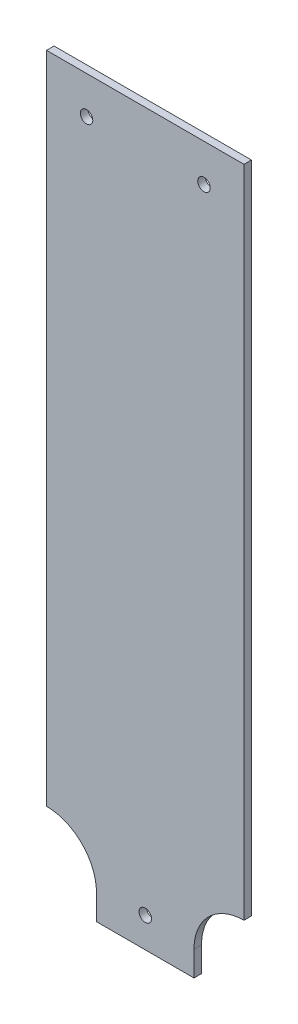
ISO-10303-21;
HEADER;
FILE_DESCRIPTION(('STEP AP214'),'2;1');
FILE_NAME('part.step','',(''),(''),'','','');
FILE_SCHEMA(('AUTOMOTIVE_DESIGN { 1 0 10303 214 1 1 1 1 }'));
ENDSEC;
DATA;
#1=APPLICATION_CONTEXT('core data for automotive mechanical design processes');
#2=APPLICATION_PROTOCOL_DEFINITION('international standard','automotive_design',2000,#1);
#3=PRODUCT_CONTEXT('',#1,'mechanical');
#4=PRODUCT('Part','Part','',(#3));
#5=PRODUCT_RELATED_PRODUCT_CATEGORY('part','',(#4));
#6=PRODUCT_DEFINITION_FORMATION('','',#4);
#7=PRODUCT_DEFINITION_CONTEXT('part definition',#1,'design');
#8=PRODUCT_DEFINITION('design','',#6,#7);
#9=PRODUCT_DEFINITION_SHAPE('','',#8);
#10=(LENGTH_UNIT() NAMED_UNIT(*) SI_UNIT(.MILLI.,.METRE.));
#11=(NAMED_UNIT(*) PLANE_ANGLE_UNIT() SI_UNIT($,.RADIAN.));
#12=(NAMED_UNIT(*) SI_UNIT($,.STERADIAN.) SOLID_ANGLE_UNIT());
#13=UNCERTAINTY_MEASURE_WITH_UNIT(LENGTH_MEASURE(1.E-05),#10,'distance_accuracy_value','');
#14=(GEOMETRIC_REPRESENTATION_CONTEXT(3) GLOBAL_UNCERTAINTY_ASSIGNED_CONTEXT((#13)) GLOBAL_UNIT_ASSIGNED_CONTEXT((#10,
#11,#12)) REPRESENTATION_CONTEXT('',''));
#15=CARTESIAN_POINT('',(0.,0.,0.));
#16=DIRECTION('',(0.,0.,1.));
#17=DIRECTION('',(1.,0.,0.));
#18=AXIS2_PLACEMENT_3D('',#15,#16,#17);
#19=CARTESIAN_POINT('',(-39.5,9.99999999999999,3.));
#20=DIRECTION('',(0.,0.,-1.));
#21=DIRECTION('',(-1.,0.,0.));
#22=AXIS2_PLACEMENT_3D('',#19,#20,#21);
#23=PLANE('',#22);
#24=CARTESIAN_POINT('',(23.5,277.,3.));
#25=DIRECTION('',(0.,0.,1.));
#26=DIRECTION('',(-1.,0.,0.));
#27=AXIS2_PLACEMENT_3D('',#24,#25,#26);
#28=CIRCLE('',#27,2.5);
#29=CARTESIAN_POINT('',(21.,277.,3.));
#30=VERTEX_POINT('',#29);
#31=EDGE_CURVE('E180',#30,#30,#28,.T.);
#32=ORIENTED_EDGE('',*,*,#31,.F.);
#33=EDGE_LOOP('',(#32));
#34=FACE_BOUND('',#33,.T.);
#35=DIRECTION('',(0.,-1.,0.));
#36=VECTOR('',#35,1.);
#37=CARTESIAN_POINT('',(-39.5,292.,3.));
#38=LINE('',#37,#36);
#39=CARTESIAN_POINT('',(-39.5,292.,3.));
#40=VERTEX_POINT('',#39);
#41=CARTESIAN_POINT('',(-39.5,30.,3.));
#42=VERTEX_POINT('',#41);
#43=EDGE_CURVE('E143',#40,#42,#38,.T.);
#44=ORIENTED_EDGE('',*,*,#43,.T.);
#45=CARTESIAN_POINT('',(-39.5,9.99999999999999,3.));
#46=DIRECTION('',(0.,0.,-1.));
#47=DIRECTION('',(-1.,0.,0.));
#48=AXIS2_PLACEMENT_3D('',#45,#46,#47);
#49=CIRCLE('',#48,20.);
#50=CARTESIAN_POINT('',(-19.5,9.99999999999999,3.));
#51=VERTEX_POINT('',#50);
#52=EDGE_CURVE('E91',#42,#51,#49,.T.);
#53=ORIENTED_EDGE('',*,*,#52,.T.);
#54=DIRECTION('',(0.,-1.,0.));
#55=VECTOR('',#54,1.);
#56=CARTESIAN_POINT('',(-19.5,0.,3.));
#57=LINE('',#56,#55);
#58=CARTESIAN_POINT('',(-19.5,0.,3.));
#59=VERTEX_POINT('',#58);
#60=EDGE_CURVE('E158',#51,#59,#57,.T.);
#61=ORIENTED_EDGE('',*,*,#60,.T.);
#62=DIRECTION('',(1.,0.,0.));
#63=VECTOR('',#62,1.);
#64=CARTESIAN_POINT('',(19.5,0.,3.));
#65=LINE('',#64,#63);
#66=CARTESIAN_POINT('',(19.5,0.,3.));
#67=VERTEX_POINT('',#66);
#68=EDGE_CURVE('E171',#59,#67,#65,.T.);
#69=ORIENTED_EDGE('',*,*,#68,.T.);
#70=DIRECTION('',(0.,1.,0.));
#71=VECTOR('',#70,1.);
#72=CARTESIAN_POINT('',(19.5,0.,3.));
#73=LINE('',#72,#71);
#74=CARTESIAN_POINT('',(19.5,9.99999999999999,3.));
#75=VERTEX_POINT('',#74);
#76=EDGE_CURVE('E110',#67,#75,#73,.T.);
#77=ORIENTED_EDGE('',*,*,#76,.T.);
#78=CARTESIAN_POINT('',(39.5,9.99999999999999,3.));
#79=DIRECTION('',(0.,0.,-1.));
#80=DIRECTION('',(1.,0.,0.));
#81=AXIS2_PLACEMENT_3D('',#78,#79,#80);
#82=CIRCLE('',#81,20.);
#83=CARTESIAN_POINT('',(39.5,30.,3.));
#84=VERTEX_POINT('',#83);
#85=EDGE_CURVE('E104',#75,#84,#82,.T.);
#86=ORIENTED_EDGE('',*,*,#85,.T.);
#87=DIRECTION('',(0.,1.,0.));
#88=VECTOR('',#87,1.);
#89=CARTESIAN_POINT('',(39.5,292.,3.));
#90=LINE('',#89,#88);
#91=CARTESIAN_POINT('',(39.5,292.,3.));
#92=VERTEX_POINT('',#91);
#93=EDGE_CURVE('E108',#84,#92,#90,.T.);
#94=ORIENTED_EDGE('',*,*,#93,.T.);
#95=DIRECTION('',(-1.,0.,0.));
#96=VECTOR('',#95,1.);
#97=CARTESIAN_POINT('',(39.5,292.,3.));
#98=LINE('',#97,#96);
#99=EDGE_CURVE('E48',#92,#40,#98,.T.);
#100=ORIENTED_EDGE('',*,*,#99,.T.);
#101=EDGE_LOOP('',(#44,#53,#61,#69,#77,#86,#94,#100));
#102=FACE_BOUND('',#101,.T.);
#103=CARTESIAN_POINT('',(-23.5,277.,3.));
#104=DIRECTION('',(0.,0.,1.));
#105=DIRECTION('',(1.,0.,0.));
#106=AXIS2_PLACEMENT_3D('',#103,#104,#105);
#107=CIRCLE('',#106,2.5);
#108=CARTESIAN_POINT('',(-21.,277.,3.));
#109=VERTEX_POINT('',#108);
#110=EDGE_CURVE('E132',#109,#109,#107,.T.);
#111=ORIENTED_EDGE('',*,*,#110,.F.);
#112=EDGE_LOOP('',(#111));
#113=FACE_BOUND('',#112,.T.);
#114=CARTESIAN_POINT('',(0.,12.,3.));
#115=DIRECTION('',(0.,0.,1.));
#116=DIRECTION('',(1.,0.,0.));
#117=AXIS2_PLACEMENT_3D('',#114,#115,#116);
#118=CIRCLE('',#117,2.5);
#119=CARTESIAN_POINT('',(2.5,12.,3.));
#120=VERTEX_POINT('',#119);
#121=EDGE_CURVE('E186',#120,#120,#118,.T.);
#122=ORIENTED_EDGE('',*,*,#121,.F.);
#123=EDGE_LOOP('',(#122));
#124=FACE_BOUND('',#123,.T.);
#125=ADVANCED_FACE('F31',(#34,#102,#113,#124),#23,.F.);
#126=CARTESIAN_POINT('',(-39.5,9.99999999999999,0.));
#127=DIRECTION('',(0.,0.,-1.));
#128=DIRECTION('',(-1.,0.,0.));
#129=AXIS2_PLACEMENT_3D('',#126,#127,#128);
#130=PLANE('',#129);
#131=CARTESIAN_POINT('',(23.5,277.,0.));
#132=DIRECTION('',(0.,0.,1.));
#133=DIRECTION('',(-1.,0.,0.));
#134=AXIS2_PLACEMENT_3D('',#131,#132,#133);
#135=CIRCLE('',#134,2.5);
#136=CARTESIAN_POINT('',(21.,277.,0.));
#137=VERTEX_POINT('',#136);
#138=EDGE_CURVE('E183',#137,#137,#135,.T.);
#139=ORIENTED_EDGE('',*,*,#138,.T.);
#140=EDGE_LOOP('',(#139));
#141=FACE_BOUND('',#140,.T.);
#142=DIRECTION('',(0.,-1.,0.));
#143=VECTOR('',#142,1.);
#144=CARTESIAN_POINT('',(-39.5,292.,0.));
#145=LINE('',#144,#143);
#146=CARTESIAN_POINT('',(-39.5,292.,0.));
#147=VERTEX_POINT('',#146);
#148=CARTESIAN_POINT('',(-39.5,30.,0.));
#149=VERTEX_POINT('',#148);
#150=EDGE_CURVE('E128',#147,#149,#145,.T.);
#151=ORIENTED_EDGE('',*,*,#150,.F.);
#152=DIRECTION('',(-1.,0.,0.));
#153=VECTOR('',#152,1.);
#154=CARTESIAN_POINT('',(39.5,292.,0.));
#155=LINE('',#154,#153);
#156=CARTESIAN_POINT('',(39.5,292.,0.));
#157=VERTEX_POINT('',#156);
#158=EDGE_CURVE('E83',#157,#147,#155,.T.);
#159=ORIENTED_EDGE('',*,*,#158,.F.);
#160=DIRECTION('',(0.,1.,0.));
#161=VECTOR('',#160,1.);
#162=CARTESIAN_POINT('',(39.5,292.,0.));
#163=LINE('',#162,#161);
#164=CARTESIAN_POINT('',(39.5,30.,0.));
#165=VERTEX_POINT('',#164);
#166=EDGE_CURVE('E77',#165,#157,#163,.T.);
#167=ORIENTED_EDGE('',*,*,#166,.F.);
#168=CARTESIAN_POINT('',(39.5,9.99999999999999,0.));
#169=DIRECTION('',(0.,0.,-1.));
#170=DIRECTION('',(1.,0.,0.));
#171=AXIS2_PLACEMENT_3D('',#168,#169,#170);
#172=CIRCLE('',#171,20.);
#173=CARTESIAN_POINT('',(19.5,9.99999999999999,0.));
#174=VERTEX_POINT('',#173);
#175=EDGE_CURVE('E118',#174,#165,#172,.T.);
#176=ORIENTED_EDGE('',*,*,#175,.F.);
#177=DIRECTION('',(0.,1.,0.));
#178=VECTOR('',#177,1.);
#179=CARTESIAN_POINT('',(19.5,0.,0.));
#180=LINE('',#179,#178);
#181=CARTESIAN_POINT('',(19.5,0.,0.));
#182=VERTEX_POINT('',#181);
#183=EDGE_CURVE('E138',#182,#174,#180,.T.);
#184=ORIENTED_EDGE('',*,*,#183,.F.);
#185=DIRECTION('',(1.,0.,0.));
#186=VECTOR('',#185,1.);
#187=CARTESIAN_POINT('',(19.5,0.,0.));
#188=LINE('',#187,#186);
#189=CARTESIAN_POINT('',(-19.5,0.,0.));
#190=VERTEX_POINT('',#189);
#191=EDGE_CURVE('E136',#190,#182,#188,.T.);
#192=ORIENTED_EDGE('',*,*,#191,.F.);
#193=DIRECTION('',(0.,-1.,0.));
#194=VECTOR('',#193,1.);
#195=CARTESIAN_POINT('',(-19.5,0.,0.));
#196=LINE('',#195,#194);
#197=CARTESIAN_POINT('',(-19.5,9.99999999999999,0.));
#198=VERTEX_POINT('',#197);
#199=EDGE_CURVE('E134',#198,#190,#196,.T.);
#200=ORIENTED_EDGE('',*,*,#199,.F.);
#201=CARTESIAN_POINT('',(-39.5,9.99999999999999,0.));
#202=DIRECTION('',(0.,0.,-1.));
#203=DIRECTION('',(-1.,0.,0.));
#204=AXIS2_PLACEMENT_3D('',#201,#202,#203);
#205=CIRCLE('',#204,20.);
#206=EDGE_CURVE('E131',#149,#198,#205,.T.);
#207=ORIENTED_EDGE('',*,*,#206,.F.);
#208=EDGE_LOOP('',(#151,#159,#167,#176,#184,#192,#200,#207));
#209=FACE_BOUND('',#208,.T.);
#210=CARTESIAN_POINT('',(-23.5,277.,0.));
#211=DIRECTION('',(0.,0.,1.));
#212=DIRECTION('',(1.,0.,0.));
#213=AXIS2_PLACEMENT_3D('',#210,#211,#212);
#214=CIRCLE('',#213,2.5);
#215=CARTESIAN_POINT('',(-21.,277.,0.));
#216=VERTEX_POINT('',#215);
#217=EDGE_CURVE('E177',#216,#216,#214,.T.);
#218=ORIENTED_EDGE('',*,*,#217,.T.);
#219=EDGE_LOOP('',(#218));
#220=FACE_BOUND('',#219,.T.);
#221=CARTESIAN_POINT('',(0.,12.,0.));
#222=DIRECTION('',(0.,0.,1.));
#223=DIRECTION('',(1.,0.,0.));
#224=AXIS2_PLACEMENT_3D('',#221,#222,#223);
#225=CIRCLE('',#224,2.5);
#226=CARTESIAN_POINT('',(2.5,12.,0.));
#227=VERTEX_POINT('',#226);
#228=EDGE_CURVE('E189',#227,#227,#225,.T.);
#229=ORIENTED_EDGE('',*,*,#228,.T.);
#230=EDGE_LOOP('',(#229));
#231=FACE_BOUND('',#230,.T.);
#232=ADVANCED_FACE('F162',(#141,#209,#220,#231),#130,.T.);
#233=CARTESIAN_POINT('',(-39.5,292.,3.));
#234=DIRECTION('',(1.,0.,0.));
#235=DIRECTION('',(0.,1.,0.));
#236=AXIS2_PLACEMENT_3D('',#233,#234,#235);
#237=PLANE('',#236);
#238=ORIENTED_EDGE('',*,*,#150,.T.);
#239=DIRECTION('',(0.,0.,-1.));
#240=VECTOR('',#239,1.);
#241=CARTESIAN_POINT('',(-39.5,30.,3.));
#242=LINE('',#241,#240);
#243=EDGE_CURVE('E11',#42,#149,#242,.T.);
#244=ORIENTED_EDGE('',*,*,#243,.F.);
#245=ORIENTED_EDGE('',*,*,#43,.F.);
#246=DIRECTION('',(0.,0.,-1.));
#247=VECTOR('',#246,1.);
#248=CARTESIAN_POINT('',(-39.5,292.,3.));
#249=LINE('',#248,#247);
#250=EDGE_CURVE('E124',#40,#147,#249,.T.);
#251=ORIENTED_EDGE('',*,*,#250,.T.);
#252=EDGE_LOOP('',(#238,#244,#245,#251));
#253=FACE_BOUND('',#252,.T.);
#254=ADVANCED_FACE('F33',(#253),#237,.F.);
#255=CARTESIAN_POINT('',(-39.5,9.99999999999999,3.));
#256=DIRECTION('',(0.,0.,-1.));
#257=DIRECTION('',(-1.,0.,0.));
#258=AXIS2_PLACEMENT_3D('',#255,#256,#257);
#259=CYLINDRICAL_SURFACE('',#258,20.);
#260=ORIENTED_EDGE('',*,*,#206,.T.);
#261=DIRECTION('',(0.,0.,-1.));
#262=VECTOR('',#261,1.);
#263=CARTESIAN_POINT('',(-19.5,9.99999999999999,3.));
#264=LINE('',#263,#262);
#265=EDGE_CURVE('E40',#51,#198,#264,.T.);
#266=ORIENTED_EDGE('',*,*,#265,.F.);
#267=ORIENTED_EDGE('',*,*,#52,.F.);
#268=ORIENTED_EDGE('',*,*,#243,.T.);
#269=EDGE_LOOP('',(#260,#266,#267,#268));
#270=FACE_BOUND('',#269,.T.);
#271=ADVANCED_FACE('F223',(#270),#259,.F.);
#272=CARTESIAN_POINT('',(-19.5,0.,3.));
#273=DIRECTION('',(1.,0.,0.));
#274=DIRECTION('',(0.,1.,0.));
#275=AXIS2_PLACEMENT_3D('',#272,#273,#274);
#276=PLANE('',#275);
#277=ORIENTED_EDGE('',*,*,#199,.T.);
#278=DIRECTION('',(0.,0.,-1.));
#279=VECTOR('',#278,1.);
#280=CARTESIAN_POINT('',(-19.5,0.,3.));
#281=LINE('',#280,#279);
#282=EDGE_CURVE('E150',#59,#190,#281,.T.);
#283=ORIENTED_EDGE('',*,*,#282,.F.);
#284=ORIENTED_EDGE('',*,*,#60,.F.);
#285=ORIENTED_EDGE('',*,*,#265,.T.);
#286=EDGE_LOOP('',(#277,#283,#284,#285));
#287=FACE_BOUND('',#286,.T.);
#288=ADVANCED_FACE('F156',(#287),#276,.F.);
#289=CARTESIAN_POINT('',(19.5,0.,3.));
#290=DIRECTION('',(0.,1.,0.));
#291=DIRECTION('',(0.,0.,1.));
#292=AXIS2_PLACEMENT_3D('',#289,#290,#291);
#293=PLANE('',#292);
#294=ORIENTED_EDGE('',*,*,#191,.T.);
#295=DIRECTION('',(0.,0.,-1.));
#296=VECTOR('',#295,1.);
#297=CARTESIAN_POINT('',(19.5,0.,3.));
#298=LINE('',#297,#296);
#299=EDGE_CURVE('E147',#67,#182,#298,.T.);
#300=ORIENTED_EDGE('',*,*,#299,.F.);
#301=ORIENTED_EDGE('',*,*,#68,.F.);
#302=ORIENTED_EDGE('',*,*,#282,.T.);
#303=EDGE_LOOP('',(#294,#300,#301,#302));
#304=FACE_BOUND('',#303,.T.);
#305=ADVANCED_FACE('F167',(#304),#293,.F.);
#306=CARTESIAN_POINT('',(19.5,0.,3.));
#307=DIRECTION('',(-1.,0.,0.));
#308=DIRECTION('',(0.,-1.,0.));
#309=AXIS2_PLACEMENT_3D('',#306,#307,#308);
#310=PLANE('',#309);
#311=ORIENTED_EDGE('',*,*,#183,.T.);
#312=DIRECTION('',(0.,0.,-1.));
#313=VECTOR('',#312,1.);
#314=CARTESIAN_POINT('',(19.5,9.99999999999999,3.));
#315=LINE('',#314,#313);
#316=EDGE_CURVE('E119',#75,#174,#315,.T.);
#317=ORIENTED_EDGE('',*,*,#316,.F.);
#318=ORIENTED_EDGE('',*,*,#76,.F.);
#319=ORIENTED_EDGE('',*,*,#299,.T.);
#320=EDGE_LOOP('',(#311,#317,#318,#319));
#321=FACE_BOUND('',#320,.T.);
#322=ADVANCED_FACE('F170',(#321),#310,.F.);
#323=CARTESIAN_POINT('',(39.5,9.99999999999999,3.));
#324=DIRECTION('',(0.,0.,-1.));
#325=DIRECTION('',(-1.,0.,0.));
#326=AXIS2_PLACEMENT_3D('',#323,#324,#325);
#327=CYLINDRICAL_SURFACE('',#326,20.);
#328=ORIENTED_EDGE('',*,*,#175,.T.);
#329=DIRECTION('',(0.,0.,-1.));
#330=VECTOR('',#329,1.);
#331=CARTESIAN_POINT('',(39.5,30.,3.));
#332=LINE('',#331,#330);
#333=EDGE_CURVE('E115',#84,#165,#332,.T.);
#334=ORIENTED_EDGE('',*,*,#333,.F.);
#335=ORIENTED_EDGE('',*,*,#85,.F.);
#336=ORIENTED_EDGE('',*,*,#316,.T.);
#337=EDGE_LOOP('',(#328,#334,#335,#336));
#338=FACE_BOUND('',#337,.T.);
#339=ADVANCED_FACE('F116',(#338),#327,.F.);
#340=CARTESIAN_POINT('',(39.5,292.,3.));
#341=DIRECTION('',(-1.,0.,0.));
#342=DIRECTION('',(0.,-1.,0.));
#343=AXIS2_PLACEMENT_3D('',#340,#341,#342);
#344=PLANE('',#343);
#345=ORIENTED_EDGE('',*,*,#166,.T.);
#346=DIRECTION('',(0.,0.,-1.));
#347=VECTOR('',#346,1.);
#348=CARTESIAN_POINT('',(39.5,292.,3.));
#349=LINE('',#348,#347);
#350=EDGE_CURVE('E120',#92,#157,#349,.T.);
#351=ORIENTED_EDGE('',*,*,#350,.F.);
#352=ORIENTED_EDGE('',*,*,#93,.F.);
#353=ORIENTED_EDGE('',*,*,#333,.T.);
#354=EDGE_LOOP('',(#345,#351,#352,#353));
#355=FACE_BOUND('',#354,.T.);
#356=ADVANCED_FACE('F122',(#355),#344,.F.);
#357=CARTESIAN_POINT('',(39.5,292.,3.));
#358=DIRECTION('',(0.,-1.,0.));
#359=DIRECTION('',(0.,0.,-1.));
#360=AXIS2_PLACEMENT_3D('',#357,#358,#359);
#361=PLANE('',#360);
#362=ORIENTED_EDGE('',*,*,#158,.T.);
#363=ORIENTED_EDGE('',*,*,#250,.F.);
#364=ORIENTED_EDGE('',*,*,#99,.F.);
#365=ORIENTED_EDGE('',*,*,#350,.T.);
#366=EDGE_LOOP('',(#362,#363,#364,#365));
#367=FACE_BOUND('',#366,.T.);
#368=ADVANCED_FACE('F211',(#367),#361,.F.);
#369=CARTESIAN_POINT('',(-23.5,277.,3.));
#370=DIRECTION('',(0.,0.,-1.));
#371=DIRECTION('',(-1.,0.,0.));
#372=AXIS2_PLACEMENT_3D('',#369,#370,#371);
#373=CYLINDRICAL_SURFACE('',#372,2.5);
#374=ORIENTED_EDGE('',*,*,#110,.T.);
#375=EDGE_LOOP('',(#374));
#376=FACE_BOUND('',#375,.T.);
#377=ORIENTED_EDGE('',*,*,#217,.F.);
#378=EDGE_LOOP('',(#377));
#379=FACE_BOUND('',#378,.T.);
#380=ADVANCED_FACE('F208',(#376,#379),#373,.F.);
#381=CARTESIAN_POINT('',(23.5,277.,3.));
#382=DIRECTION('',(0.,0.,-1.));
#383=DIRECTION('',(-1.,0.,0.));
#384=AXIS2_PLACEMENT_3D('',#381,#382,#383);
#385=CYLINDRICAL_SURFACE('',#384,2.5);
#386=ORIENTED_EDGE('',*,*,#31,.T.);
#387=EDGE_LOOP('',(#386));
#388=FACE_BOUND('',#387,.T.);
#389=ORIENTED_EDGE('',*,*,#138,.F.);
#390=EDGE_LOOP('',(#389));
#391=FACE_BOUND('',#390,.T.);
#392=ADVANCED_FACE('F287',(#388,#391),#385,.F.);
#393=CARTESIAN_POINT('',(0.,12.,3.));
#394=DIRECTION('',(0.,0.,-1.));
#395=DIRECTION('',(-1.,0.,0.));
#396=AXIS2_PLACEMENT_3D('',#393,#394,#395);
#397=CYLINDRICAL_SURFACE('',#396,2.5);
#398=ORIENTED_EDGE('',*,*,#121,.T.);
#399=EDGE_LOOP('',(#398));
#400=FACE_BOUND('',#399,.T.);
#401=ORIENTED_EDGE('',*,*,#228,.F.);
#402=EDGE_LOOP('',(#401));
#403=FACE_BOUND('',#402,.T.);
#404=ADVANCED_FACE('F195',(#400,#403),#397,.F.);
#405=CLOSED_SHELL('',(#125,#232,#254,#271,#288,#305,#322,#339,#356,#368,#380,#392,#404));
#406=MANIFOLD_SOLID_BREP('B2',#405);
#407=ADVANCED_BREP_SHAPE_REPRESENTATION('',(#18,#406),#14);
#408=SHAPE_DEFINITION_REPRESENTATION(#9,#407);
ENDSEC;
END-ISO-10303-21;
